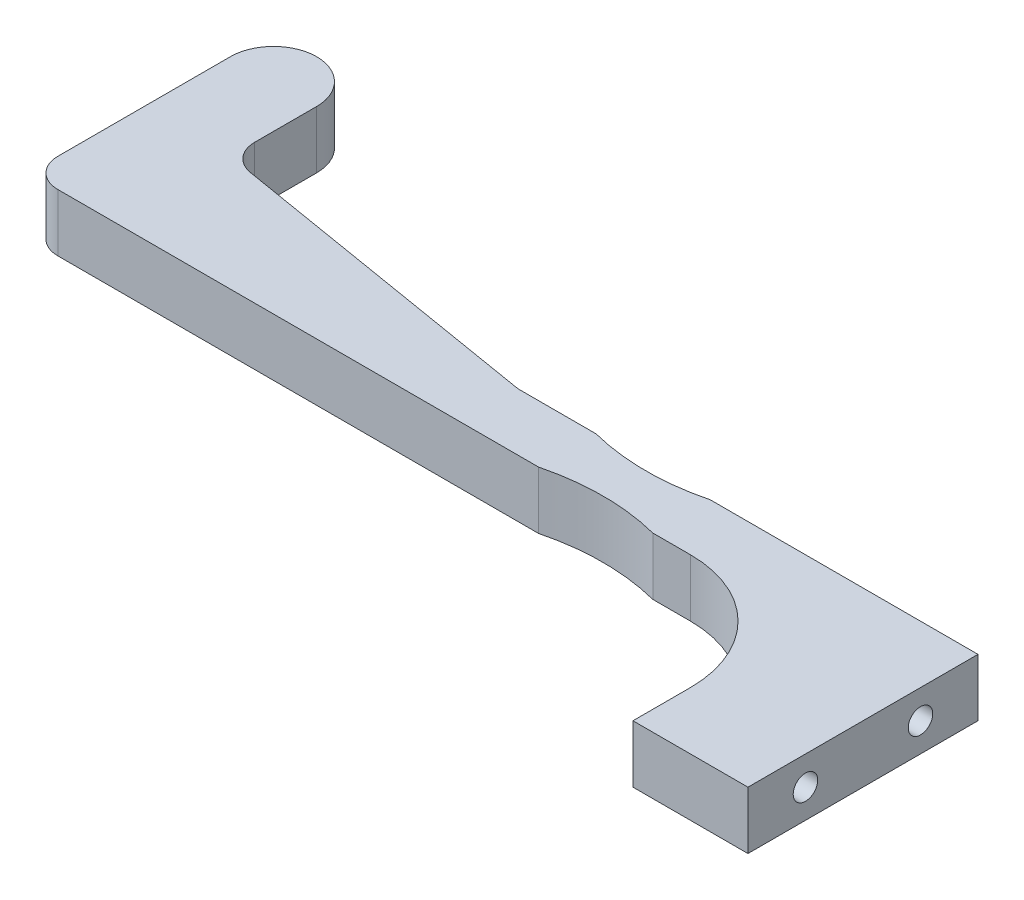
ISO-10303-21;
HEADER;
FILE_DESCRIPTION(('STEP AP214'),'2;1');
FILE_NAME('part.step','',(''),(''),'','','');
FILE_SCHEMA(('AUTOMOTIVE_DESIGN { 1 0 10303 214 1 1 1 1 }'));
ENDSEC;
DATA;
#1=APPLICATION_CONTEXT('core data for automotive mechanical design processes');
#2=APPLICATION_PROTOCOL_DEFINITION('international standard','automotive_design',2000,#1);
#3=PRODUCT_CONTEXT('',#1,'mechanical');
#4=PRODUCT('Part','Part','',(#3));
#5=PRODUCT_RELATED_PRODUCT_CATEGORY('part','',(#4));
#6=PRODUCT_DEFINITION_FORMATION('','',#4);
#7=PRODUCT_DEFINITION_CONTEXT('part definition',#1,'design');
#8=PRODUCT_DEFINITION('design','',#6,#7);
#9=PRODUCT_DEFINITION_SHAPE('','',#8);
#10=(LENGTH_UNIT() NAMED_UNIT(*) SI_UNIT(.MILLI.,.METRE.));
#11=(NAMED_UNIT(*) PLANE_ANGLE_UNIT() SI_UNIT($,.RADIAN.));
#12=(NAMED_UNIT(*) SI_UNIT($,.STERADIAN.) SOLID_ANGLE_UNIT());
#13=UNCERTAINTY_MEASURE_WITH_UNIT(LENGTH_MEASURE(1.E-05),#10,'distance_accuracy_value','');
#14=(GEOMETRIC_REPRESENTATION_CONTEXT(3) GLOBAL_UNCERTAINTY_ASSIGNED_CONTEXT((#13)) GLOBAL_UNIT_ASSIGNED_CONTEXT((#10,
#11,#12)) REPRESENTATION_CONTEXT('',''));
#15=CARTESIAN_POINT('',(0.,0.,0.));
#16=DIRECTION('',(0.,0.,1.));
#17=DIRECTION('',(1.,0.,0.));
#18=AXIS2_PLACEMENT_3D('',#15,#16,#17);
#19=CARTESIAN_POINT('',(80.9625,6.35,20.6375));
#20=DIRECTION('',(0.,0.,1.));
#21=DIRECTION('',(1.,0.,0.));
#22=AXIS2_PLACEMENT_3D('',#19,#20,#21);
#23=PLANE('',#22);
#24=DIRECTION('',(-1.,0.,0.));
#25=VECTOR('',#24,1.);
#26=CARTESIAN_POINT('',(80.9625,0.,20.6375));
#27=LINE('',#26,#25);
#28=CARTESIAN_POINT('',(93.6625,0.,20.6375));
#29=VERTEX_POINT('',#28);
#30=CARTESIAN_POINT('',(64.1050021181428,0.,20.6375));
#31=VERTEX_POINT('',#30);
#32=EDGE_CURVE('E217',#29,#31,#27,.T.);
#33=ORIENTED_EDGE('',*,*,#32,.T.);
#34=DIRECTION('',(0.,1.,0.));
#35=VECTOR('',#34,1.);
#36=CARTESIAN_POINT('',(64.1050021181428,0.,20.6375));
#37=LINE('',#36,#35);
#38=CARTESIAN_POINT('',(64.1050021181427,6.35,20.6375));
#39=VERTEX_POINT('',#38);
#40=EDGE_CURVE('E57',#31,#39,#37,.T.);
#41=ORIENTED_EDGE('',*,*,#40,.T.);
#42=DIRECTION('',(-1.,0.,0.));
#43=VECTOR('',#42,1.);
#44=CARTESIAN_POINT('',(93.6625,6.35,20.6375));
#45=LINE('',#44,#43);
#46=CARTESIAN_POINT('',(93.6625,6.35,20.6375));
#47=VERTEX_POINT('',#46);
#48=EDGE_CURVE('E181',#47,#39,#45,.T.);
#49=ORIENTED_EDGE('',*,*,#48,.F.);
#50=DIRECTION('',(0.,-1.,0.));
#51=VECTOR('',#50,1.);
#52=CARTESIAN_POINT('',(93.6625,6.35,20.6375));
#53=LINE('',#52,#51);
#54=EDGE_CURVE('E189',#47,#29,#53,.T.);
#55=ORIENTED_EDGE('',*,*,#54,.T.);
#56=EDGE_LOOP('',(#33,#41,#49,#55));
#57=FACE_BOUND('',#56,.T.);
#58=ADVANCED_FACE('F41',(#57),#23,.F.);
#59=CARTESIAN_POINT('',(-4.7625,6.35,26.9875));
#60=DIRECTION('',(0.,0.,-1.));
#61=DIRECTION('',(-1.,0.,0.));
#62=AXIS2_PLACEMENT_3D('',#59,#60,#61);
#63=PLANE('',#62);
#64=DIRECTION('',(1.,0.,0.));
#65=VECTOR('',#64,1.);
#66=CARTESIAN_POINT('',(-4.7625,0.,26.9875));
#67=LINE('',#66,#65);
#68=CARTESIAN_POINT('',(-1.5875,0.,26.9875));
#69=VERTEX_POINT('',#68);
#70=CARTESIAN_POINT('',(51.5046114991976,0.,26.9875));
#71=VERTEX_POINT('',#70);
#72=EDGE_CURVE('E206',#69,#71,#67,.T.);
#73=ORIENTED_EDGE('',*,*,#72,.T.);
#74=DIRECTION('',(0.,1.,0.));
#75=VECTOR('',#74,1.);
#76=CARTESIAN_POINT('',(51.5046114991976,0.,26.9875));
#77=LINE('',#76,#75);
#78=CARTESIAN_POINT('',(51.5046114991976,6.35,26.9875));
#79=VERTEX_POINT('',#78);
#80=EDGE_CURVE('E64',#71,#79,#77,.T.);
#81=ORIENTED_EDGE('',*,*,#80,.T.);
#82=DIRECTION('',(1.,0.,0.));
#83=VECTOR('',#82,1.);
#84=CARTESIAN_POINT('',(-4.7625,6.35,26.9875));
#85=LINE('',#84,#83);
#86=CARTESIAN_POINT('',(-1.5875,6.35,26.9875));
#87=VERTEX_POINT('',#86);
#88=EDGE_CURVE('E384',#87,#79,#85,.T.);
#89=ORIENTED_EDGE('',*,*,#88,.F.);
#90=DIRECTION('',(0.,-1.,0.));
#91=VECTOR('',#90,1.);
#92=CARTESIAN_POINT('',(-1.5875,6.35,26.9875));
#93=LINE('',#92,#91);
#94=EDGE_CURVE('E235',#87,#69,#93,.T.);
#95=ORIENTED_EDGE('',*,*,#94,.T.);
#96=EDGE_LOOP('',(#73,#81,#89,#95));
#97=FACE_BOUND('',#96,.T.);
#98=ADVANCED_FACE('F322',(#97),#63,.F.);
#99=CARTESIAN_POINT('',(42.8625,6.35,20.6375));
#100=DIRECTION('',(-0.164398987305357,0.,0.986393923832144));
#101=DIRECTION('',(0.986393923832144,0.,0.164398987305357));
#102=AXIS2_PLACEMENT_3D('',#99,#100,#101);
#103=PLANE('',#102);
#104=DIRECTION('',(-0.986393923832144,0.,-0.164398987305357));
#105=VECTOR('',#104,1.);
#106=CARTESIAN_POINT('',(42.8625,6.35,20.6375));
#107=LINE('',#106,#105);
#108=CARTESIAN_POINT('',(42.6033042490023,6.35,20.5943007081671));
#109=VERTEX_POINT('',#108);
#110=CARTESIAN_POINT('',(7.41553321530549,6.35,14.7296722025509));
#111=VERTEX_POINT('',#110);
#112=EDGE_CURVE('E220',#109,#111,#107,.T.);
#113=ORIENTED_EDGE('',*,*,#112,.F.);
#114=DIRECTION('',(0.,-1.,0.));
#115=VECTOR('',#114,1.);
#116=CARTESIAN_POINT('',(42.6033042490023,0.,20.5943007081671));
#117=LINE('',#116,#115);
#118=CARTESIAN_POINT('',(42.6033042490023,0.,20.5943007081671));
#119=VERTEX_POINT('',#118);
#120=EDGE_CURVE('E246',#109,#119,#117,.T.);
#121=ORIENTED_EDGE('',*,*,#120,.T.);
#122=DIRECTION('',(-0.986393923832144,0.,-0.164398987305357));
#123=VECTOR('',#122,1.);
#124=CARTESIAN_POINT('',(42.8625,0.,20.6375));
#125=LINE('',#124,#123);
#126=CARTESIAN_POINT('',(7.41553321530549,0.,14.7296722025509));
#127=VERTEX_POINT('',#126);
#128=EDGE_CURVE('E194',#119,#127,#125,.T.);
#129=ORIENTED_EDGE('',*,*,#128,.T.);
#130=DIRECTION('',(0.,-1.,0.));
#131=VECTOR('',#130,1.);
#132=CARTESIAN_POINT('',(7.41553321530549,6.35,14.7296722025509));
#133=LINE('',#132,#131);
#134=EDGE_CURVE('E244',#127,#111,#133,.F.);
#135=ORIENTED_EDGE('',*,*,#134,.T.);
#136=EDGE_LOOP('',(#113,#121,#129,#135));
#137=FACE_BOUND('',#136,.T.);
#138=ADVANCED_FACE('F333',(#137),#103,.F.);
#139=CARTESIAN_POINT('',(4.7625,6.35,4.7625));
#140=DIRECTION('',(-1.,0.,0.));
#141=DIRECTION('',(0.,0.,1.));
#142=AXIS2_PLACEMENT_3D('',#139,#140,#141);
#143=PLANE('',#142);
#144=DIRECTION('',(0.,0.,-1.));
#145=VECTOR('',#144,1.);
#146=CARTESIAN_POINT('',(4.7625,6.35,4.7625));
#147=LINE('',#146,#145);
#148=CARTESIAN_POINT('',(4.7625,6.35,11.5978714943839));
#149=VERTEX_POINT('',#148);
#150=CARTESIAN_POINT('',(4.7625,6.35,4.7625));
#151=VERTEX_POINT('',#150);
#152=EDGE_CURVE('E400',#149,#151,#147,.T.);
#153=ORIENTED_EDGE('',*,*,#152,.F.);
#154=DIRECTION('',(0.,-1.,0.));
#155=VECTOR('',#154,1.);
#156=CARTESIAN_POINT('',(4.7625,0.,11.5978714943839));
#157=LINE('',#156,#155);
#158=CARTESIAN_POINT('',(4.7625,0.,11.5978714943839));
#159=VERTEX_POINT('',#158);
#160=EDGE_CURVE('E250',#149,#159,#157,.T.);
#161=ORIENTED_EDGE('',*,*,#160,.T.);
#162=DIRECTION('',(0.,0.,-1.));
#163=VECTOR('',#162,1.);
#164=CARTESIAN_POINT('',(4.7625,0.,4.7625));
#165=LINE('',#164,#163);
#166=CARTESIAN_POINT('',(4.7625,0.,4.7625));
#167=VERTEX_POINT('',#166);
#168=EDGE_CURVE('E197',#159,#167,#165,.T.);
#169=ORIENTED_EDGE('',*,*,#168,.T.);
#170=DIRECTION('',(0.,-1.,0.));
#171=VECTOR('',#170,1.);
#172=CARTESIAN_POINT('',(4.7625,6.35,4.7625));
#173=LINE('',#172,#171);
#174=EDGE_CURVE('E232',#151,#167,#173,.T.);
#175=ORIENTED_EDGE('',*,*,#174,.F.);
#176=EDGE_LOOP('',(#153,#161,#169,#175));
#177=FACE_BOUND('',#176,.T.);
#178=ADVANCED_FACE('F329',(#177),#143,.F.);
#179=CARTESIAN_POINT('',(0.,6.35,4.7625));
#180=DIRECTION('',(0.,-1.,0.));
#181=DIRECTION('',(0.,0.,-1.));
#182=AXIS2_PLACEMENT_3D('',#179,#180,#181);
#183=CYLINDRICAL_SURFACE('',#182,4.7625);
#184=CARTESIAN_POINT('',(0.,0.,4.7625));
#185=DIRECTION('',(0.,1.,0.));
#186=DIRECTION('',(0.,0.,1.));
#187=AXIS2_PLACEMENT_3D('',#184,#185,#186);
#188=CIRCLE('',#187,4.7625);
#189=CARTESIAN_POINT('',(-4.7625,0.,4.7625));
#190=VERTEX_POINT('',#189);
#191=EDGE_CURVE('E200',#167,#190,#188,.T.);
#192=ORIENTED_EDGE('',*,*,#191,.T.);
#193=DIRECTION('',(0.,-1.,0.));
#194=VECTOR('',#193,1.);
#195=CARTESIAN_POINT('',(-4.7625,6.35,4.7625));
#196=LINE('',#195,#194);
#197=CARTESIAN_POINT('',(-4.7625,6.35,4.7625));
#198=VERTEX_POINT('',#197);
#199=EDGE_CURVE('E229',#198,#190,#196,.T.);
#200=ORIENTED_EDGE('',*,*,#199,.F.);
#201=CARTESIAN_POINT('',(0.,6.35,4.7625));
#202=DIRECTION('',(0.,1.,0.));
#203=DIRECTION('',(0.,0.,1.));
#204=AXIS2_PLACEMENT_3D('',#201,#202,#203);
#205=CIRCLE('',#204,4.7625);
#206=EDGE_CURVE('E394',#151,#198,#205,.T.);
#207=ORIENTED_EDGE('',*,*,#206,.F.);
#208=ORIENTED_EDGE('',*,*,#174,.T.);
#209=EDGE_LOOP('',(#192,#200,#207,#208));
#210=FACE_BOUND('',#209,.T.);
#211=ADVANCED_FACE('F325',(#210),#183,.T.);
#212=CARTESIAN_POINT('',(-4.7625,6.35,4.7625));
#213=DIRECTION('',(1.,0.,0.));
#214=DIRECTION('',(0.,0.,-1.));
#215=AXIS2_PLACEMENT_3D('',#212,#213,#214);
#216=PLANE('',#215);
#217=DIRECTION('',(0.,0.,1.));
#218=VECTOR('',#217,1.);
#219=CARTESIAN_POINT('',(-4.7625,0.,4.7625));
#220=LINE('',#219,#218);
#221=CARTESIAN_POINT('',(-4.7625,0.,23.8125));
#222=VERTEX_POINT('',#221);
#223=EDGE_CURVE('E202',#190,#222,#220,.T.);
#224=ORIENTED_EDGE('',*,*,#223,.T.);
#225=DIRECTION('',(0.,-1.,0.));
#226=VECTOR('',#225,1.);
#227=CARTESIAN_POINT('',(-4.7625,6.35,23.8125));
#228=LINE('',#227,#226);
#229=CARTESIAN_POINT('',(-4.7625,6.35,23.8125));
#230=VERTEX_POINT('',#229);
#231=EDGE_CURVE('E240',#222,#230,#228,.F.);
#232=ORIENTED_EDGE('',*,*,#231,.T.);
#233=DIRECTION('',(0.,0.,1.));
#234=VECTOR('',#233,1.);
#235=CARTESIAN_POINT('',(-4.7625,6.35,4.7625));
#236=LINE('',#235,#234);
#237=EDGE_CURVE('E392',#198,#230,#236,.T.);
#238=ORIENTED_EDGE('',*,*,#237,.F.);
#239=ORIENTED_EDGE('',*,*,#199,.T.);
#240=EDGE_LOOP('',(#224,#232,#238,#239));
#241=FACE_BOUND('',#240,.T.);
#242=ADVANCED_FACE('F320',(#241),#216,.F.);
#243=CARTESIAN_POINT('',(64.1050021181428,6.35,26.9875));
#244=VERTEX_POINT('',#243);
#245=CARTESIAN_POINT('',(68.2625,6.35,26.9875));
#246=VERTEX_POINT('',#245);
#247=EDGE_CURVE('E378',#244,#246,#85,.T.);
#248=ORIENTED_EDGE('',*,*,#247,.F.);
#249=DIRECTION('',(0.,1.,0.));
#250=VECTOR('',#249,1.);
#251=CARTESIAN_POINT('',(64.1050021181428,0.,26.9875));
#252=LINE('',#251,#250);
#253=CARTESIAN_POINT('',(64.1050021181428,0.,26.9875));
#254=VERTEX_POINT('',#253);
#255=EDGE_CURVE('E379',#244,#254,#252,.F.);
#256=ORIENTED_EDGE('',*,*,#255,.T.);
#257=CARTESIAN_POINT('',(68.2625,0.,26.9875));
#258=VERTEX_POINT('',#257);
#259=EDGE_CURVE('E205',#254,#258,#67,.T.);
#260=ORIENTED_EDGE('',*,*,#259,.T.);
#261=DIRECTION('',(0.,-1.,0.));
#262=VECTOR('',#261,1.);
#263=CARTESIAN_POINT('',(68.2625,6.35,26.9875));
#264=LINE('',#263,#262);
#265=EDGE_CURVE('E266',#258,#246,#264,.F.);
#266=ORIENTED_EDGE('',*,*,#265,.T.);
#267=EDGE_LOOP('',(#248,#256,#260,#266));
#268=FACE_BOUND('',#267,.T.);
#269=ADVANCED_FACE('F316',(#268),#63,.F.);
#270=CARTESIAN_POINT('',(80.9625,6.35,26.9875));
#271=DIRECTION('',(1.,0.,0.));
#272=DIRECTION('',(0.,0.,-1.));
#273=AXIS2_PLACEMENT_3D('',#270,#271,#272);
#274=PLANE('',#273);
#275=DIRECTION('',(0.,-1.,0.));
#276=VECTOR('',#275,1.);
#277=CARTESIAN_POINT('',(80.9625,0.,39.6875));
#278=LINE('',#277,#276);
#279=CARTESIAN_POINT('',(80.9625,6.35,39.6875));
#280=VERTEX_POINT('',#279);
#281=CARTESIAN_POINT('',(80.9625,4.52754999999999,39.6875));
#282=VERTEX_POINT('',#281);
#283=EDGE_CURVE('E263',#280,#282,#278,.T.);
#284=ORIENTED_EDGE('',*,*,#283,.T.);
#285=CARTESIAN_POINT('',(80.9625,3.175,39.6875));
#286=DIRECTION('',(1.,0.,0.));
#287=DIRECTION('',(0.,0.,-1.));
#288=AXIS2_PLACEMENT_3D('',#285,#286,#287);
#289=CIRCLE('',#288,1.35254999999999);
#290=CARTESIAN_POINT('',(80.9625,1.82245000000001,39.6875));
#291=VERTEX_POINT('',#290);
#292=EDGE_CURVE('E373',#282,#291,#289,.T.);
#293=ORIENTED_EDGE('',*,*,#292,.T.);
#294=CARTESIAN_POINT('',(80.9625,0.,39.6875));
#295=VERTEX_POINT('',#294);
#296=EDGE_CURVE('E262',#291,#295,#278,.T.);
#297=ORIENTED_EDGE('',*,*,#296,.T.);
#298=DIRECTION('',(0.,0.,1.));
#299=VECTOR('',#298,1.);
#300=CARTESIAN_POINT('',(80.9625,0.,26.9875));
#301=LINE('',#300,#299);
#302=CARTESIAN_POINT('',(80.9625,0.,46.0375));
#303=VERTEX_POINT('',#302);
#304=EDGE_CURVE('E209',#295,#303,#301,.T.);
#305=ORIENTED_EDGE('',*,*,#304,.T.);
#306=DIRECTION('',(0.,-1.,0.));
#307=VECTOR('',#306,1.);
#308=CARTESIAN_POINT('',(80.9625,6.35,46.0375));
#309=LINE('',#308,#307);
#310=CARTESIAN_POINT('',(80.9625,6.35,46.0375));
#311=VERTEX_POINT('',#310);
#312=EDGE_CURVE('E226',#311,#303,#309,.T.);
#313=ORIENTED_EDGE('',*,*,#312,.F.);
#314=DIRECTION('',(0.,0.,1.));
#315=VECTOR('',#314,1.);
#316=CARTESIAN_POINT('',(80.9625,6.35,26.9875));
#317=LINE('',#316,#315);
#318=EDGE_CURVE('E414',#280,#311,#317,.T.);
#319=ORIENTED_EDGE('',*,*,#318,.F.);
#320=EDGE_LOOP('',(#284,#293,#297,#305,#313,#319));
#321=FACE_BOUND('',#320,.T.);
#322=ADVANCED_FACE('F312',(#321),#274,.F.);
#323=CARTESIAN_POINT('',(80.9625,6.35,46.0375));
#324=DIRECTION('',(0.,0.,-1.));
#325=DIRECTION('',(-1.,0.,0.));
#326=AXIS2_PLACEMENT_3D('',#323,#324,#325);
#327=PLANE('',#326);
#328=DIRECTION('',(1.,0.,0.));
#329=VECTOR('',#328,1.);
#330=CARTESIAN_POINT('',(80.9625,0.,46.0375));
#331=LINE('',#330,#329);
#332=CARTESIAN_POINT('',(93.6625,0.,46.0375));
#333=VERTEX_POINT('',#332);
#334=EDGE_CURVE('E211',#303,#333,#331,.T.);
#335=ORIENTED_EDGE('',*,*,#334,.T.);
#336=DIRECTION('',(0.,-1.,0.));
#337=VECTOR('',#336,1.);
#338=CARTESIAN_POINT('',(93.6625,6.35,46.0375));
#339=LINE('',#338,#337);
#340=CARTESIAN_POINT('',(93.6625,6.35,46.0375));
#341=VERTEX_POINT('',#340);
#342=EDGE_CURVE('E223',#341,#333,#339,.T.);
#343=ORIENTED_EDGE('',*,*,#342,.F.);
#344=DIRECTION('',(1.,0.,0.));
#345=VECTOR('',#344,1.);
#346=CARTESIAN_POINT('',(80.9625,6.35,46.0375));
#347=LINE('',#346,#345);
#348=EDGE_CURVE('E190',#311,#341,#347,.T.);
#349=ORIENTED_EDGE('',*,*,#348,.F.);
#350=ORIENTED_EDGE('',*,*,#312,.T.);
#351=EDGE_LOOP('',(#335,#343,#349,#350));
#352=FACE_BOUND('',#351,.T.);
#353=ADVANCED_FACE('F308',(#352),#327,.F.);
#354=CARTESIAN_POINT('',(93.6625,6.35,20.6375));
#355=DIRECTION('',(-1.,0.,0.));
#356=DIRECTION('',(0.,0.,1.));
#357=AXIS2_PLACEMENT_3D('',#354,#355,#356);
#358=PLANE('',#357);
#359=CARTESIAN_POINT('',(93.6625,3.175,39.6875));
#360=DIRECTION('',(1.,0.,0.));
#361=DIRECTION('',(0.,0.,-1.));
#362=AXIS2_PLACEMENT_3D('',#359,#360,#361);
#363=CIRCLE('',#362,1.35254999999999);
#364=CARTESIAN_POINT('',(93.6625,3.175,38.3349500000001));
#365=VERTEX_POINT('',#364);
#366=EDGE_CURVE('E417',#365,#365,#363,.T.);
#367=ORIENTED_EDGE('',*,*,#366,.F.);
#368=EDGE_LOOP('',(#367));
#369=FACE_BOUND('',#368,.T.);
#370=CARTESIAN_POINT('',(93.6625,3.175,26.9875000000001));
#371=DIRECTION('',(1.,0.,0.));
#372=DIRECTION('',(0.,0.,-1.));
#373=AXIS2_PLACEMENT_3D('',#370,#371,#372);
#374=CIRCLE('',#373,1.35254999999999);
#375=CARTESIAN_POINT('',(93.6625,3.175,25.6349500000001));
#376=VERTEX_POINT('',#375);
#377=EDGE_CURVE('E416',#376,#376,#374,.T.);
#378=ORIENTED_EDGE('',*,*,#377,.F.);
#379=EDGE_LOOP('',(#378));
#380=FACE_BOUND('',#379,.T.);
#381=DIRECTION('',(0.,0.,-1.));
#382=VECTOR('',#381,1.);
#383=CARTESIAN_POINT('',(93.6625,0.,20.6375));
#384=LINE('',#383,#382);
#385=EDGE_CURVE('E213',#333,#29,#384,.T.);
#386=ORIENTED_EDGE('',*,*,#385,.T.);
#387=ORIENTED_EDGE('',*,*,#54,.F.);
#388=DIRECTION('',(0.,0.,-1.));
#389=VECTOR('',#388,1.);
#390=CARTESIAN_POINT('',(93.6625,6.35,20.6375));
#391=LINE('',#390,#389);
#392=EDGE_CURVE('E187',#341,#47,#391,.T.);
#393=ORIENTED_EDGE('',*,*,#392,.F.);
#394=ORIENTED_EDGE('',*,*,#342,.T.);
#395=EDGE_LOOP('',(#386,#387,#393,#394));
#396=FACE_BOUND('',#395,.T.);
#397=ADVANCED_FACE('F305',(#369,#380,#396),#358,.F.);
#398=CARTESIAN_POINT('',(51.5046114991977,6.35,20.6375));
#399=VERTEX_POINT('',#398);
#400=CARTESIAN_POINT('',(43.1252710336969,6.35,20.6375));
#401=VERTEX_POINT('',#400);
#402=EDGE_CURVE('E178',#399,#401,#45,.T.);
#403=ORIENTED_EDGE('',*,*,#402,.F.);
#404=DIRECTION('',(0.,1.,0.));
#405=VECTOR('',#404,1.);
#406=CARTESIAN_POINT('',(51.5046114991977,0.,20.6375));
#407=LINE('',#406,#405);
#408=CARTESIAN_POINT('',(51.5046114991977,0.,20.6375));
#409=VERTEX_POINT('',#408);
#410=EDGE_CURVE('E167',#399,#409,#407,.F.);
#411=ORIENTED_EDGE('',*,*,#410,.T.);
#412=CARTESIAN_POINT('',(43.1252710336968,0.,20.6375));
#413=VERTEX_POINT('',#412);
#414=EDGE_CURVE('E216',#409,#413,#27,.T.);
#415=ORIENTED_EDGE('',*,*,#414,.T.);
#416=DIRECTION('',(0.,-1.,0.));
#417=VECTOR('',#416,1.);
#418=CARTESIAN_POINT('',(43.1252710336968,6.35,20.6375));
#419=LINE('',#418,#417);
#420=EDGE_CURVE('E185',#413,#401,#419,.F.);
#421=ORIENTED_EDGE('',*,*,#420,.T.);
#422=EDGE_LOOP('',(#403,#411,#415,#421));
#423=FACE_BOUND('',#422,.T.);
#424=ADVANCED_FACE('F183',(#423),#23,.F.);
#425=CARTESIAN_POINT('',(0.,6.35,4.7625));
#426=DIRECTION('',(0.,1.,0.));
#427=DIRECTION('',(0.,0.,1.));
#428=AXIS2_PLACEMENT_3D('',#425,#426,#427);
#429=PLANE('',#428);
#430=CARTESIAN_POINT('',(57.8048068086702,6.35,-3.96875000000001));
#431=DIRECTION('',(0.,1.,0.));
#432=DIRECTION('',(0.,0.,1.));
#433=AXIS2_PLACEMENT_3D('',#430,#431,#432);
#434=CIRCLE('',#433,25.4);
#435=EDGE_CURVE('E170',#399,#39,#434,.T.);
#436=ORIENTED_EDGE('',*,*,#435,.F.);
#437=ORIENTED_EDGE('',*,*,#402,.T.);
#438=CARTESIAN_POINT('',(43.1252710336968,6.35,17.4625));
#439=DIRECTION('',(0.,1.,0.));
#440=DIRECTION('',(0.,0.,1.));
#441=AXIS2_PLACEMENT_3D('',#438,#439,#440);
#442=CIRCLE('',#441,3.175);
#443=EDGE_CURVE('E256',#401,#109,#442,.F.);
#444=ORIENTED_EDGE('',*,*,#443,.T.);
#445=ORIENTED_EDGE('',*,*,#112,.T.);
#446=CARTESIAN_POINT('',(7.9375,6.35,11.5978714943839));
#447=DIRECTION('',(0.,1.,0.));
#448=DIRECTION('',(0.,0.,1.));
#449=AXIS2_PLACEMENT_3D('',#446,#447,#448);
#450=CIRCLE('',#449,3.175);
#451=EDGE_CURVE('E260',#111,#149,#450,.F.);
#452=ORIENTED_EDGE('',*,*,#451,.T.);
#453=ORIENTED_EDGE('',*,*,#152,.T.);
#454=ORIENTED_EDGE('',*,*,#206,.T.);
#455=ORIENTED_EDGE('',*,*,#237,.T.);
#456=CARTESIAN_POINT('',(-1.5875,6.35,23.8125));
#457=DIRECTION('',(0.,1.,0.));
#458=DIRECTION('',(0.,0.,1.));
#459=AXIS2_PLACEMENT_3D('',#456,#457,#458);
#460=CIRCLE('',#459,3.175);
#461=EDGE_CURVE('E242',#230,#87,#460,.T.);
#462=ORIENTED_EDGE('',*,*,#461,.T.);
#463=ORIENTED_EDGE('',*,*,#88,.T.);
#464=CARTESIAN_POINT('',(57.8048068086702,6.35,51.59375));
#465=DIRECTION('',(0.,1.,0.));
#466=DIRECTION('',(0.,0.,1.));
#467=AXIS2_PLACEMENT_3D('',#464,#465,#466);
#468=CIRCLE('',#467,25.4);
#469=EDGE_CURVE('E425',#244,#79,#468,.T.);
#470=ORIENTED_EDGE('',*,*,#469,.F.);
#471=ORIENTED_EDGE('',*,*,#247,.T.);
#472=CARTESIAN_POINT('',(68.2625,6.35,39.6875));
#473=DIRECTION('',(0.,1.,0.));
#474=DIRECTION('',(0.,0.,1.));
#475=AXIS2_PLACEMENT_3D('',#472,#473,#474);
#476=CIRCLE('',#475,12.7);
#477=EDGE_CURVE('E272',#246,#280,#476,.F.);
#478=ORIENTED_EDGE('',*,*,#477,.T.);
#479=ORIENTED_EDGE('',*,*,#318,.T.);
#480=ORIENTED_EDGE('',*,*,#348,.T.);
#481=ORIENTED_EDGE('',*,*,#392,.T.);
#482=ORIENTED_EDGE('',*,*,#48,.T.);
#483=EDGE_LOOP('',(#436,#437,#444,#445,#452,#453,#454,#455,#462,#463,#470,#471,#478,#479,#480,
#481,#482));
#484=FACE_BOUND('',#483,.T.);
#485=ADVANCED_FACE('F177',(#484),#429,.T.);
#486=CARTESIAN_POINT('',(0.,0.,4.7625));
#487=DIRECTION('',(0.,1.,0.));
#488=DIRECTION('',(0.,0.,1.));
#489=AXIS2_PLACEMENT_3D('',#486,#487,#488);
#490=PLANE('',#489);
#491=ORIENTED_EDGE('',*,*,#414,.F.);
#492=CARTESIAN_POINT('',(57.8048068086702,0.,-3.96875000000001));
#493=DIRECTION('',(0.,1.,0.));
#494=DIRECTION('',(0.,0.,1.));
#495=AXIS2_PLACEMENT_3D('',#492,#493,#494);
#496=CIRCLE('',#495,25.4);
#497=EDGE_CURVE('E12',#409,#31,#496,.T.);
#498=ORIENTED_EDGE('',*,*,#497,.T.);
#499=ORIENTED_EDGE('',*,*,#32,.F.);
#500=ORIENTED_EDGE('',*,*,#385,.F.);
#501=ORIENTED_EDGE('',*,*,#334,.F.);
#502=ORIENTED_EDGE('',*,*,#304,.F.);
#503=CARTESIAN_POINT('',(68.2625,0.,39.6875));
#504=DIRECTION('',(0.,1.,0.));
#505=DIRECTION('',(0.,0.,1.));
#506=AXIS2_PLACEMENT_3D('',#503,#504,#505);
#507=CIRCLE('',#506,12.7);
#508=EDGE_CURVE('E269',#295,#258,#507,.T.);
#509=ORIENTED_EDGE('',*,*,#508,.T.);
#510=ORIENTED_EDGE('',*,*,#259,.F.);
#511=CARTESIAN_POINT('',(57.8048068086702,0.,51.59375));
#512=DIRECTION('',(0.,1.,0.));
#513=DIRECTION('',(0.,0.,1.));
#514=AXIS2_PLACEMENT_3D('',#511,#512,#513);
#515=CIRCLE('',#514,25.4);
#516=EDGE_CURVE('E50',#254,#71,#515,.T.);
#517=ORIENTED_EDGE('',*,*,#516,.T.);
#518=ORIENTED_EDGE('',*,*,#72,.F.);
#519=CARTESIAN_POINT('',(-1.5875,0.,23.8125));
#520=DIRECTION('',(0.,1.,0.));
#521=DIRECTION('',(0.,0.,1.));
#522=AXIS2_PLACEMENT_3D('',#519,#520,#521);
#523=CIRCLE('',#522,3.175);
#524=EDGE_CURVE('E238',#69,#222,#523,.F.);
#525=ORIENTED_EDGE('',*,*,#524,.T.);
#526=ORIENTED_EDGE('',*,*,#223,.F.);
#527=ORIENTED_EDGE('',*,*,#191,.F.);
#528=ORIENTED_EDGE('',*,*,#168,.F.);
#529=CARTESIAN_POINT('',(7.9375,0.,11.5978714943839));
#530=DIRECTION('',(0.,1.,0.));
#531=DIRECTION('',(0.,0.,1.));
#532=AXIS2_PLACEMENT_3D('',#529,#530,#531);
#533=CIRCLE('',#532,3.175);
#534=EDGE_CURVE('E258',#159,#127,#533,.T.);
#535=ORIENTED_EDGE('',*,*,#534,.T.);
#536=ORIENTED_EDGE('',*,*,#128,.F.);
#537=CARTESIAN_POINT('',(43.1252710336968,0.,17.4625));
#538=DIRECTION('',(0.,1.,0.));
#539=DIRECTION('',(0.,0.,1.));
#540=AXIS2_PLACEMENT_3D('',#537,#538,#539);
#541=CIRCLE('',#540,3.175);
#542=EDGE_CURVE('E253',#119,#413,#541,.T.);
#543=ORIENTED_EDGE('',*,*,#542,.T.);
#544=EDGE_LOOP('',(#491,#498,#499,#500,#501,#502,#509,#510,#517,#518,#525,#526,#527,#528,#535,
#536,#543));
#545=FACE_BOUND('',#544,.T.);
#546=ADVANCED_FACE('F298',(#545),#490,.F.);
#547=CARTESIAN_POINT('',(-1.5875,6.35,23.8125));
#548=DIRECTION('',(0.,-1.,0.));
#549=DIRECTION('',(0.,0.,-1.));
#550=AXIS2_PLACEMENT_3D('',#547,#548,#549);
#551=CYLINDRICAL_SURFACE('',#550,3.175);
#552=ORIENTED_EDGE('',*,*,#461,.F.);
#553=ORIENTED_EDGE('',*,*,#231,.F.);
#554=ORIENTED_EDGE('',*,*,#524,.F.);
#555=ORIENTED_EDGE('',*,*,#94,.F.);
#556=EDGE_LOOP('',(#552,#553,#554,#555));
#557=FACE_BOUND('',#556,.T.);
#558=ADVANCED_FACE('F301',(#557),#551,.T.);
#559=CARTESIAN_POINT('',(43.1252710336968,6.35,17.4625));
#560=DIRECTION('',(0.,1.,0.));
#561=DIRECTION('',(0.,0.,1.));
#562=AXIS2_PLACEMENT_3D('',#559,#560,#561);
#563=CYLINDRICAL_SURFACE('',#562,3.175);
#564=ORIENTED_EDGE('',*,*,#443,.F.);
#565=ORIENTED_EDGE('',*,*,#420,.F.);
#566=ORIENTED_EDGE('',*,*,#542,.F.);
#567=ORIENTED_EDGE('',*,*,#120,.F.);
#568=EDGE_LOOP('',(#564,#565,#566,#567));
#569=FACE_BOUND('',#568,.T.);
#570=ADVANCED_FACE('F340',(#569),#563,.F.);
#571=CARTESIAN_POINT('',(7.9375,6.35,11.5978714943839));
#572=DIRECTION('',(0.,1.,0.));
#573=DIRECTION('',(0.,0.,1.));
#574=AXIS2_PLACEMENT_3D('',#571,#572,#573);
#575=CYLINDRICAL_SURFACE('',#574,3.175);
#576=ORIENTED_EDGE('',*,*,#451,.F.);
#577=ORIENTED_EDGE('',*,*,#134,.F.);
#578=ORIENTED_EDGE('',*,*,#534,.F.);
#579=ORIENTED_EDGE('',*,*,#160,.F.);
#580=EDGE_LOOP('',(#576,#577,#578,#579));
#581=FACE_BOUND('',#580,.T.);
#582=ADVANCED_FACE('F343',(#581),#575,.F.);
#583=CARTESIAN_POINT('',(68.2625,6.35,39.6875));
#584=DIRECTION('',(0.,1.,0.));
#585=DIRECTION('',(0.,0.,1.));
#586=AXIS2_PLACEMENT_3D('',#583,#584,#585);
#587=CYLINDRICAL_SURFACE('',#586,12.7);
#588=ORIENTED_EDGE('',*,*,#296,.F.);
#589=CARTESIAN_POINT('',(80.9625,1.82245000000001,39.6875));
#590=CARTESIAN_POINT('',(80.9625009490096,1.8224501257724,39.6495614605861));
#591=CARTESIAN_POINT('',(80.9623297849286,1.82404724792288,39.6116412001858));
#592=CARTESIAN_POINT('',(80.9616532983663,1.83041798605632,39.5360740995345));
#593=CARTESIAN_POINT('',(80.96114799879,1.83519138430464,39.4984272407207));
#594=CARTESIAN_POINT('',(80.9591483961329,1.85422688928845,39.3863806865046));
#595=CARTESIAN_POINT('',(80.9571703170282,1.87320445469481,39.3127348334281));
#596=CARTESIAN_POINT('',(80.9521422892876,1.92319171939454,39.1696994731092));
#597=CARTESIAN_POINT('',(80.9490919476544,1.95420583066319,39.1003115374124));
#598=CARTESIAN_POINT('',(80.9422605822384,2.02737557175276,38.9677227562985));
#599=CARTESIAN_POINT('',(80.9384796399582,2.06952995900424,38.9045212219364));
#600=CARTESIAN_POINT('',(80.9305935642825,2.16396051537856,38.7858561149098));
#601=CARTESIAN_POINT('',(80.9264873376236,2.21627175646064,38.7304205343108));
#602=CARTESIAN_POINT('',(80.9184219607543,2.3294630507688,38.6290911565726));
#603=CARTESIAN_POINT('',(80.9144628331512,2.39034441428904,38.5831988211721));
#604=CARTESIAN_POINT('',(80.9071291649634,2.51912348929109,38.5021651113701));
#605=CARTESIAN_POINT('',(80.903756046037,2.58703764303725,38.4670497280871));
#606=CARTESIAN_POINT('',(80.8979905738212,2.72783642980664,38.4087343298555));
#607=CARTESIAN_POINT('',(80.8955981343876,2.80072062559811,38.3855332682908));
#608=CARTESIAN_POINT('',(80.8920748763948,2.94910126560595,38.3517873858996));
#609=CARTESIAN_POINT('',(80.8909393082693,3.02458675640621,38.3411949072121));
#610=CARTESIAN_POINT('',(80.8900436771946,3.17627384306099,38.3328194487663));
#611=CARTESIAN_POINT('',(80.8902836070817,3.25247543518394,38.3350364022954));
#612=CARTESIAN_POINT('',(80.8921075704729,3.4030980973277,38.3521780925215));
#613=CARTESIAN_POINT('',(80.8936860493903,3.47752522058287,38.3670503144394));
#614=CARTESIAN_POINT('',(80.8980005752883,3.62282069449866,38.408998547558));
#615=CARTESIAN_POINT('',(80.9007366338776,3.69368900946219,38.4360746811446));
#616=CARTESIAN_POINT('',(80.9070644722062,3.83002212288032,38.5017203187411));
#617=CARTESIAN_POINT('',(80.9106579920145,3.89547556424411,38.5403132345053));
#618=CARTESIAN_POINT('',(80.9182942105728,4.01899337840204,38.6278784508708));
#619=CARTESIAN_POINT('',(80.9223369044595,4.07705783118517,38.6768506390968));
#620=CARTESIAN_POINT('',(80.9304402790955,4.18445026495049,38.7840691777261));
#621=CARTESIAN_POINT('',(80.9345009514413,4.23373427027588,38.8423595809394));
#622=CARTESIAN_POINT('',(80.9421654732818,4.32183969688851,38.9664317851732));
#623=CARTESIAN_POINT('',(80.9457691846394,4.36065795840358,39.0322158401362));
#624=CARTESIAN_POINT('',(80.9521155936364,4.42672752387025,39.1694478776238));
#625=CARTESIAN_POINT('',(80.9548576003728,4.45396955228617,39.2409003478148));
#626=CARTESIAN_POINT('',(80.9591629040276,4.49601663110434,39.3873480865062));
#627=CARTESIAN_POINT('',(80.9607279805433,4.51084046253696,39.4623378232006));
#628=CARTESIAN_POINT('',(80.9619123924104,4.52202244248737,39.562796661141));
#629=CARTESIAN_POINT('',(80.9621326073994,4.52409629581783,39.5877138170655));
#630=CARTESIAN_POINT('',(80.9624262316737,4.52685820701474,39.6375838392477));
#631=CARTESIAN_POINT('',(80.9624998862965,4.52754858079856,39.6625365757368));
#632=CARTESIAN_POINT('',(80.9625,4.52754999999999,39.6875));
#633=B_SPLINE_CURVE_WITH_KNOTS('',3,(#589,#590,#591,#592,#593,#594,#595,#596,#597,#598,#599,
#600,#601,#602,#603,#604,#605,#606,#607,#608,#609,#610,#611,#612,#613,#614,#615,#616,#617,#618,
#619,#620,#621,#622,#623,#624,#625,#626,#627,#628,#629,#630,#631,#632),.UNSPECIFIED.,.F.,.F.,(4,
2,2,2,2,2,2,2,2,2,2,2,2,2,2,2,2,2,2,2,2,4),(0.,0.113745378279722,0.22748296008382,
0.454542960015922,0.681686267128893,0.908804249707921,1.13672089232228,1.36467241925279,
1.59316946054861,1.82164642603962,2.04925702499796,2.2768664385452,2.50353593573977,
2.73020770611866,2.95734343935261,3.18447671353484,3.41271739473338,3.64102690840123,
3.86951901325423,4.09766492417382,4.1726498130261,4.24750907345231),.UNSPECIFIED.);
#634=EDGE_CURVE('E274',#291,#282,#633,.T.);
#635=ORIENTED_EDGE('',*,*,#634,.T.);
#636=ORIENTED_EDGE('',*,*,#283,.F.);
#637=ORIENTED_EDGE('',*,*,#477,.F.);
#638=ORIENTED_EDGE('',*,*,#265,.F.);
#639=ORIENTED_EDGE('',*,*,#508,.F.);
#640=EDGE_LOOP('',(#588,#635,#636,#637,#638,#639));
#641=FACE_BOUND('',#640,.T.);
#642=ADVANCED_FACE('F43',(#641),#587,.F.);
#643=CARTESIAN_POINT('',(77.0001,3.175,26.9875000000001));
#644=DIRECTION('',(1.,0.,0.));
#645=DIRECTION('',(0.,0.,-1.));
#646=AXIS2_PLACEMENT_3D('',#643,#644,#645);
#647=CONICAL_SURFACE('',#646,1.35254999999999,1.02974425867665);
#648=CARTESIAN_POINT('',(76.1874059697343,3.175,26.9875000000001));
#649=VERTEX_POINT('',#648);
#650=VERTEX_LOOP('',#649);
#651=FACE_BOUND('',#650,.T.);
#652=CARTESIAN_POINT('',(77.0001,3.175,26.9875000000001));
#653=DIRECTION('',(1.,0.,0.));
#654=DIRECTION('',(0.,0.,-1.));
#655=AXIS2_PLACEMENT_3D('',#652,#653,#654);
#656=CIRCLE('',#655,1.35254999999999);
#657=CARTESIAN_POINT('',(77.0001,3.175,25.6349500000001));
#658=VERTEX_POINT('',#657);
#659=EDGE_CURVE('E198',#658,#658,#656,.T.);
#660=ORIENTED_EDGE('',*,*,#659,.T.);
#661=EDGE_LOOP('',(#660));
#662=FACE_BOUND('',#661,.T.);
#663=ADVANCED_FACE('F291',(#651,#662),#647,.F.);
#664=CARTESIAN_POINT('',(93.6625,3.175,26.9875000000001));
#665=DIRECTION('',(1.,0.,0.));
#666=DIRECTION('',(0.,0.,-1.));
#667=AXIS2_PLACEMENT_3D('',#664,#665,#666);
#668=CYLINDRICAL_SURFACE('',#667,1.35254999999999);
#669=ORIENTED_EDGE('',*,*,#659,.F.);
#670=EDGE_LOOP('',(#669));
#671=FACE_BOUND('',#670,.T.);
#672=ORIENTED_EDGE('',*,*,#377,.T.);
#673=EDGE_LOOP('',(#672));
#674=FACE_BOUND('',#673,.T.);
#675=ADVANCED_FACE('F286',(#671,#674),#668,.F.);
#676=CARTESIAN_POINT('',(93.6625,3.175,39.6875));
#677=DIRECTION('',(1.,0.,0.));
#678=DIRECTION('',(0.,0.,-1.));
#679=AXIS2_PLACEMENT_3D('',#676,#677,#678);
#680=CYLINDRICAL_SURFACE('',#679,1.35254999999999);
#681=ORIENTED_EDGE('',*,*,#366,.T.);
#682=EDGE_LOOP('',(#681));
#683=FACE_BOUND('',#682,.T.);
#684=ORIENTED_EDGE('',*,*,#634,.F.);
#685=ORIENTED_EDGE('',*,*,#292,.F.);
#686=EDGE_LOOP('',(#684,#685));
#687=FACE_BOUND('',#686,.T.);
#688=ADVANCED_FACE('F280',(#683,#687),#680,.F.);
#689=CARTESIAN_POINT('',(57.8048068086702,0.,51.59375));
#690=DIRECTION('',(0.,1.,0.));
#691=DIRECTION('',(0.,0.,1.));
#692=AXIS2_PLACEMENT_3D('',#689,#690,#691);
#693=CYLINDRICAL_SURFACE('',#692,25.4);
#694=ORIENTED_EDGE('',*,*,#516,.F.);
#695=ORIENTED_EDGE('',*,*,#255,.F.);
#696=ORIENTED_EDGE('',*,*,#469,.T.);
#697=ORIENTED_EDGE('',*,*,#80,.F.);
#698=EDGE_LOOP('',(#694,#695,#696,#697));
#699=FACE_BOUND('',#698,.T.);
#700=ADVANCED_FACE('F285',(#699),#693,.F.);
#701=CARTESIAN_POINT('',(57.8048068086702,0.,-3.96875000000001));
#702=DIRECTION('',(0.,1.,0.));
#703=DIRECTION('',(0.,0.,1.));
#704=AXIS2_PLACEMENT_3D('',#701,#702,#703);
#705=CYLINDRICAL_SURFACE('',#704,25.4);
#706=ORIENTED_EDGE('',*,*,#497,.F.);
#707=ORIENTED_EDGE('',*,*,#410,.F.);
#708=ORIENTED_EDGE('',*,*,#435,.T.);
#709=ORIENTED_EDGE('',*,*,#40,.F.);
#710=EDGE_LOOP('',(#706,#707,#708,#709));
#711=FACE_BOUND('',#710,.T.);
#712=ADVANCED_FACE('F169',(#711),#705,.F.);
#713=CLOSED_SHELL('',(#58,#98,#138,#178,#211,#242,#269,#322,#353,#397,#424,#485,#546,#558,#570,
#582,#642,#663,#675,#688,#700,#712));
#714=MANIFOLD_SOLID_BREP('B2',#713);
#715=ADVANCED_BREP_SHAPE_REPRESENTATION('',(#18,#714),#14);
#716=SHAPE_DEFINITION_REPRESENTATION(#9,#715);
ENDSEC;
END-ISO-10303-21;
